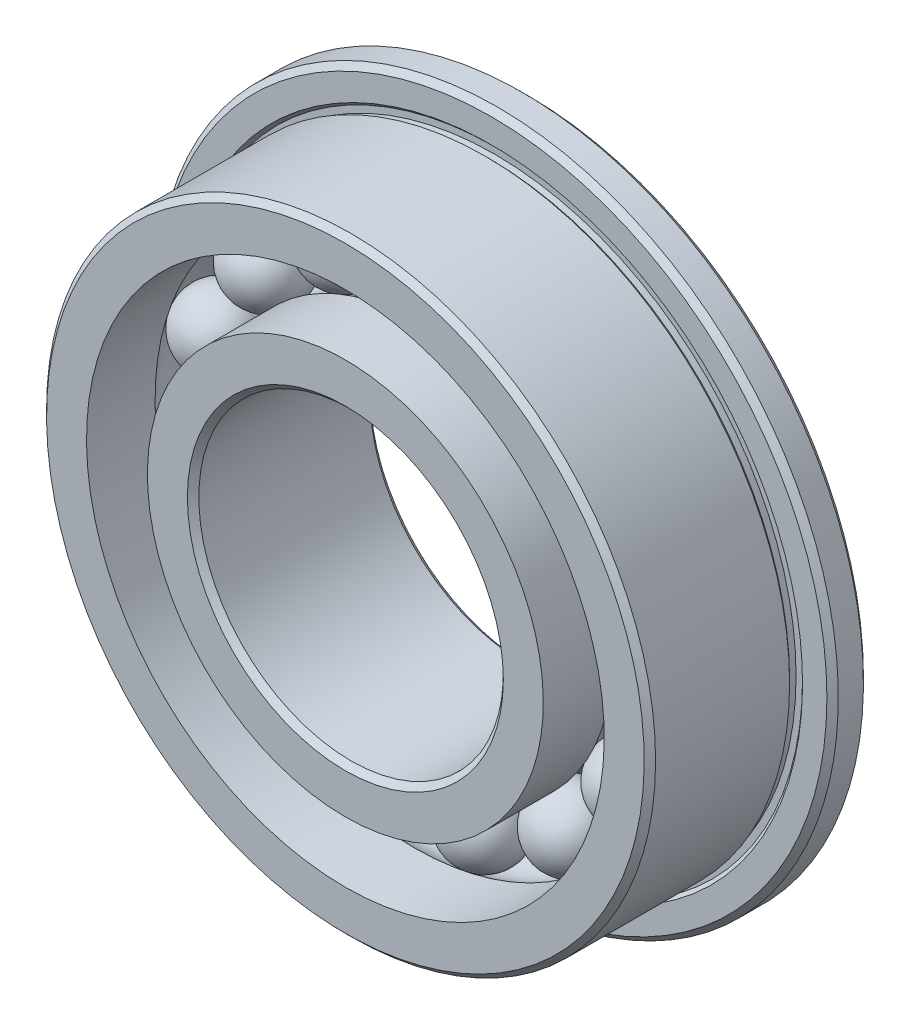
ISO-10303-21;
HEADER;
FILE_DESCRIPTION(('STEP AP214'),'2;1');
FILE_NAME('part.step','',(''),(''),'','','');
FILE_SCHEMA(('AUTOMOTIVE_DESIGN { 1 0 10303 214 1 1 1 1 }'));
ENDSEC;
DATA;
#1=APPLICATION_CONTEXT('core data for automotive mechanical design processes');
#2=APPLICATION_PROTOCOL_DEFINITION('international standard','automotive_design',2000,#1);
#3=PRODUCT_CONTEXT('',#1,'mechanical');
#4=PRODUCT('Part','Part','',(#3));
#5=PRODUCT_RELATED_PRODUCT_CATEGORY('part','',(#4));
#6=PRODUCT_DEFINITION_FORMATION('','',#4);
#7=PRODUCT_DEFINITION_CONTEXT('part definition',#1,'design');
#8=PRODUCT_DEFINITION('design','',#6,#7);
#9=PRODUCT_DEFINITION_SHAPE('','',#8);
#10=(LENGTH_UNIT() NAMED_UNIT(*) SI_UNIT(.MILLI.,.METRE.));
#11=(NAMED_UNIT(*) PLANE_ANGLE_UNIT() SI_UNIT($,.RADIAN.));
#12=(NAMED_UNIT(*) SI_UNIT($,.STERADIAN.) SOLID_ANGLE_UNIT());
#13=UNCERTAINTY_MEASURE_WITH_UNIT(LENGTH_MEASURE(1.E-05),#10,'distance_accuracy_value','');
#14=(GEOMETRIC_REPRESENTATION_CONTEXT(3) GLOBAL_UNCERTAINTY_ASSIGNED_CONTEXT((#13)) GLOBAL_UNIT_ASSIGNED_CONTEXT((#10,
#11,#12)) REPRESENTATION_CONTEXT('',''));
#15=CARTESIAN_POINT('',(0.,0.,0.));
#16=DIRECTION('',(0.,0.,1.));
#17=DIRECTION('',(1.,0.,0.));
#18=AXIS2_PLACEMENT_3D('',#15,#16,#17);
#19=CARTESIAN_POINT('',(-1.52526241153421,3.42579546615977,0.));
#20=DIRECTION('',(-0.406736643075789,0.913545457642606,0.));
#21=DIRECTION('',(0.913545457642606,0.406736643075789,0.));
#22=AXIS2_PLACEMENT_3D('',#19,#20,#21);
#23=SPHERICAL_SURFACE('',#22,0.625);
#24=CARTESIAN_POINT('',(-1.77947281345658,3.9967613771864,0.));
#25=VERTEX_POINT('',#24);
#26=VERTEX_LOOP('',#25);
#27=FACE_BOUND('',#26,.T.);
#28=ADVANCED_FACE('F39',(#27),#23,.T.);
#29=CLOSED_SHELL('',(#28));
#30=MANIFOLD_SOLID_BREP('B2',#29);
#31=CARTESIAN_POINT('',(-2.7867930955402,2.50923977384575,0.));
#32=DIRECTION('',(-0.743144825477386,0.669130606358867,0.));
#33=DIRECTION('',(0.669130606358867,0.743144825477386,0.));
#34=AXIS2_PLACEMENT_3D('',#31,#32,#33);
#35=SPHERICAL_SURFACE('',#34,0.625);
#36=CARTESIAN_POINT('',(-3.25125861146356,2.92744640282004,0.));
#37=VERTEX_POINT('',#36);
#38=VERTEX_LOOP('',#37);
#39=FACE_BOUND('',#38,.T.);
#40=ADVANCED_FACE('F57',(#39),#35,.T.);
#41=CLOSED_SHELL('',(#40));
#42=MANIFOLD_SOLID_BREP('B7',#41);
#43=CARTESIAN_POINT('',(-3.56646193610681,1.15881372890609,0.));
#44=DIRECTION('',(-0.95105651629515,0.309016994374957,0.));
#45=DIRECTION('',(0.309016994374957,0.95105651629515,0.));
#46=AXIS2_PLACEMENT_3D('',#43,#44,#45);
#47=SPHERICAL_SURFACE('',#46,0.625);
#48=CARTESIAN_POINT('',(-4.16087225879128,1.35194935039044,0.));
#49=VERTEX_POINT('',#48);
#50=VERTEX_LOOP('',#49);
#51=FACE_BOUND('',#50,.T.);
#52=ADVANCED_FACE('F75',(#51),#47,.T.);
#53=CLOSED_SHELL('',(#52));
#54=MANIFOLD_SOLID_BREP('B35',#53);
#55=CARTESIAN_POINT('',(-3.72945710763103,-0.391981737253664,0.));
#56=DIRECTION('',(-0.994521895368274,-0.104528463267644,0.));
#57=DIRECTION('',(-0.104528463267644,0.994521895368274,0.));
#58=AXIS2_PLACEMENT_3D('',#55,#56,#57);
#59=SPHERICAL_SURFACE('',#58,0.625);
#60=CARTESIAN_POINT('',(-4.3510332922362,-0.457312026795941,0.));
#61=VERTEX_POINT('',#60);
#62=VERTEX_LOOP('',#61);
#63=FACE_BOUND('',#62,.T.);
#64=ADVANCED_FACE('F93',(#63),#59,.T.);
#65=CLOSED_SHELL('',(#64));
#66=MANIFOLD_SOLID_BREP('B53',#65);
#67=CARTESIAN_POINT('',(-3.24759526419166,-1.87499999999997,0.));
#68=DIRECTION('',(-0.866025403784443,-0.499999999999992,0.));
#69=DIRECTION('',(-0.499999999999992,0.866025403784443,0.));
#70=AXIS2_PLACEMENT_3D('',#67,#68,#69);
#71=SPHERICAL_SURFACE('',#70,0.625);
#72=CARTESIAN_POINT('',(-3.78886114155694,-2.18749999999996,0.));
#73=VERTEX_POINT('',#72);
#74=VERTEX_LOOP('',#73);
#75=FACE_BOUND('',#74,.T.);
#76=ADVANCED_FACE('F111',(#75),#71,.T.);
#77=CLOSED_SHELL('',(#76));
#78=MANIFOLD_SOLID_BREP('B71',#77);
#79=CARTESIAN_POINT('',(-2.2041946960968,-3.03381372890603,0.));
#80=DIRECTION('',(-0.58778525229248,-0.809016994374943,0.));
#81=DIRECTION('',(-0.809016994374943,0.58778525229248,0.));
#82=AXIS2_PLACEMENT_3D('',#79,#80,#81);
#83=SPHERICAL_SURFACE('',#82,0.625);
#84=CARTESIAN_POINT('',(-2.5715604787796,-3.53944935039037,0.));
#85=VERTEX_POINT('',#84);
#86=VERTEX_LOOP('',#85);
#87=FACE_BOUND('',#86,.T.);
#88=ADVANCED_FACE('F129',(#87),#83,.T.);
#89=CLOSED_SHELL('',(#88));
#90=MANIFOLD_SOLID_BREP('B89',#89);
#91=CARTESIAN_POINT('',(-0.779668840566624,-3.66805350275177,0.));
#92=DIRECTION('',(-0.207911690817766,-0.978147600733804,0.));
#93=DIRECTION('',(-0.978147600733804,0.207911690817766,0.));
#94=AXIS2_PLACEMENT_3D('',#91,#92,#93);
#95=SPHERICAL_SURFACE('',#94,0.625);
#96=CARTESIAN_POINT('',(-0.909613647327728,-4.27939575321039,0.));
#97=VERTEX_POINT('',#96);
#98=VERTEX_LOOP('',#97);
#99=FACE_BOUND('',#98,.T.);
#100=ADVANCED_FACE('F147',(#99),#95,.T.);
#101=CLOSED_SHELL('',(#100));
#102=MANIFOLD_SOLID_BREP('B107',#101);
#103=CARTESIAN_POINT('',(0.779668840566575,-3.66805350275178,0.));
#104=DIRECTION('',(0.207911690817753,-0.978147600733807,0.));
#105=DIRECTION('',(-0.978147600733807,-0.207911690817753,0.));
#106=AXIS2_PLACEMENT_3D('',#103,#104,#105);
#107=SPHERICAL_SURFACE('',#106,0.625);
#108=CARTESIAN_POINT('',(0.90961364732767,-4.2793957532104,0.));
#109=VERTEX_POINT('',#108);
#110=VERTEX_LOOP('',#109);
#111=FACE_BOUND('',#110,.T.);
#112=ADVANCED_FACE('F165',(#111),#107,.T.);
#113=CLOSED_SHELL('',(#112));
#114=MANIFOLD_SOLID_BREP('B125',#113);
#115=CARTESIAN_POINT('',(2.20419469609676,-3.03381372890606,0.));
#116=DIRECTION('',(0.587785252292469,-0.80901699437495,0.));
#117=DIRECTION('',(-0.80901699437495,-0.587785252292469,0.));
#118=AXIS2_PLACEMENT_3D('',#115,#116,#117);
#119=SPHERICAL_SURFACE('',#118,0.625);
#120=CARTESIAN_POINT('',(2.57156047877955,-3.53944935039041,0.));
#121=VERTEX_POINT('',#120);
#122=VERTEX_LOOP('',#121);
#123=FACE_BOUND('',#122,.T.);
#124=ADVANCED_FACE('F183',(#123),#119,.T.);
#125=CLOSED_SHELL('',(#124));
#126=MANIFOLD_SOLID_BREP('B143',#125);
#127=CARTESIAN_POINT('',(3.24759526419164,-1.87500000000002,0.));
#128=DIRECTION('',(0.866025403784437,-0.500000000000004,0.));
#129=DIRECTION('',(-0.500000000000004,-0.866025403784437,0.));
#130=AXIS2_PLACEMENT_3D('',#127,#128,#129);
#131=SPHERICAL_SURFACE('',#130,0.625);
#132=CARTESIAN_POINT('',(3.78886114155691,-2.18750000000002,0.));
#133=VERTEX_POINT('',#132);
#134=VERTEX_LOOP('',#133);
#135=FACE_BOUND('',#134,.T.);
#136=ADVANCED_FACE('F201',(#135),#131,.T.);
#137=CLOSED_SHELL('',(#136));
#138=MANIFOLD_SOLID_BREP('B161',#137);
#139=CARTESIAN_POINT('',(3.72945710763102,-0.391981737253714,0.));
#140=DIRECTION('',(0.994521895368273,-0.104528463267657,0.));
#141=DIRECTION('',(-0.104528463267657,-0.994521895368273,0.));
#142=AXIS2_PLACEMENT_3D('',#139,#140,#141);
#143=SPHERICAL_SURFACE('',#142,0.625);
#144=CARTESIAN_POINT('',(4.35103329223619,-0.457312026796,0.));
#145=VERTEX_POINT('',#144);
#146=VERTEX_LOOP('',#145);
#147=FACE_BOUND('',#146,.T.);
#148=ADVANCED_FACE('F219',(#147),#143,.T.);
#149=CLOSED_SHELL('',(#148));
#150=MANIFOLD_SOLID_BREP('B179',#149);
#151=CARTESIAN_POINT('',(3.56646193610683,1.15881372890604,0.));
#152=DIRECTION('',(0.951056516295154,0.309016994374945,0.));
#153=DIRECTION('',(0.309016994374945,-0.951056516295154,0.));
#154=AXIS2_PLACEMENT_3D('',#151,#152,#153);
#155=SPHERICAL_SURFACE('',#154,0.625);
#156=CARTESIAN_POINT('',(4.1608722587913,1.35194935039038,0.));
#157=VERTEX_POINT('',#156);
#158=VERTEX_LOOP('',#157);
#159=FACE_BOUND('',#158,.T.);
#160=ADVANCED_FACE('F237',(#159),#155,.T.);
#161=CLOSED_SHELL('',(#160));
#162=MANIFOLD_SOLID_BREP('B197',#161);
#163=CARTESIAN_POINT('',(2.78679309554023,2.50923977384571,0.));
#164=DIRECTION('',(0.743144825477395,0.669130606358857,0.));
#165=DIRECTION('',(0.669130606358857,-0.743144825477395,0.));
#166=AXIS2_PLACEMENT_3D('',#163,#164,#165);
#167=SPHERICAL_SURFACE('',#166,0.625);
#168=CARTESIAN_POINT('',(3.25125861146361,2.92744640282,0.));
#169=VERTEX_POINT('',#168);
#170=VERTEX_LOOP('',#169);
#171=FACE_BOUND('',#170,.T.);
#172=ADVANCED_FACE('F255',(#171),#167,.T.);
#173=CLOSED_SHELL('',(#172));
#174=MANIFOLD_SOLID_BREP('B215',#173);
#175=CARTESIAN_POINT('',(1.52526241153425,3.42579546615975,0.));
#176=DIRECTION('',(0.406736643075801,0.913545457642601,0.));
#177=DIRECTION('',(0.913545457642601,-0.406736643075801,0.));
#178=AXIS2_PLACEMENT_3D('',#175,#176,#177);
#179=SPHERICAL_SURFACE('',#178,0.625);
#180=CARTESIAN_POINT('',(1.77947281345663,3.99676137718638,0.));
#181=VERTEX_POINT('',#180);
#182=VERTEX_LOOP('',#181);
#183=FACE_BOUND('',#182,.T.);
#184=ADVANCED_FACE('F273',(#183),#179,.T.);
#185=CLOSED_SHELL('',(#184));
#186=MANIFOLD_SOLID_BREP('B233',#185);
#187=CARTESIAN_POINT('',(0.,3.75,0.));
#188=DIRECTION('',(0.,1.,0.));
#189=DIRECTION('',(1.,0.,0.));
#190=AXIS2_PLACEMENT_3D('',#187,#188,#189);
#191=SPHERICAL_SURFACE('',#190,0.625);
#192=CARTESIAN_POINT('',(0.,4.375,0.));
#193=VERTEX_POINT('',#192);
#194=VERTEX_LOOP('',#193);
#195=FACE_BOUND('',#194,.T.);
#196=ADVANCED_FACE('F294',(#195),#191,.T.);
#197=CLOSED_SHELL('',(#196));
#198=MANIFOLD_SOLID_BREP('B251',#197);
#199=CARTESIAN_POINT('',(0.,0.,0.));
#200=DIRECTION('',(0.,0.,1.));
#201=DIRECTION('',(0.,-1.,0.));
#202=AXIS2_PLACEMENT_3D('',#199,#200,#201);
#203=CYLINDRICAL_SURFACE('',#202,3.25);
#204=CARTESIAN_POINT('',(0.,0.,-0.374999999999998));
#205=DIRECTION('',(0.,0.,1.));
#206=DIRECTION('',(0.,-1.,0.));
#207=AXIS2_PLACEMENT_3D('',#204,#205,#206);
#208=CIRCLE('',#207,3.25);
#209=CARTESIAN_POINT('',(0.,-3.25,-0.374999999999998));
#210=VERTEX_POINT('',#209);
#211=EDGE_CURVE('E335',#210,#210,#208,.T.);
#212=ORIENTED_EDGE('',*,*,#211,.F.);
#213=EDGE_LOOP('',(#212));
#214=FACE_BOUND('',#213,.T.);
#215=CARTESIAN_POINT('',(0.,0.,-1.5));
#216=DIRECTION('',(0.,0.,1.));
#217=DIRECTION('',(0.,-1.,0.));
#218=AXIS2_PLACEMENT_3D('',#215,#216,#217);
#219=CIRCLE('',#218,3.25);
#220=CARTESIAN_POINT('',(0.,-3.25,-1.5));
#221=VERTEX_POINT('',#220);
#222=EDGE_CURVE('E344',#221,#221,#219,.T.);
#223=ORIENTED_EDGE('',*,*,#222,.T.);
#224=EDGE_LOOP('',(#223));
#225=FACE_BOUND('',#224,.T.);
#226=ADVANCED_FACE('F315',(#214,#225),#203,.T.);
#227=CARTESIAN_POINT('',(0.,0.,0.));
#228=DIRECTION('',(0.,0.,1.));
#229=DIRECTION('',(0.,-1.,0.));
#230=AXIS2_PLACEMENT_3D('',#227,#228,#229);
#231=TOROIDAL_SURFACE('',#230,3.75,0.625);
#232=CARTESIAN_POINT('',(0.,0.,0.374999999999999));
#233=DIRECTION('',(0.,0.,1.));
#234=DIRECTION('',(0.,-1.,0.));
#235=AXIS2_PLACEMENT_3D('',#232,#233,#234);
#236=CIRCLE('',#235,3.25);
#237=CARTESIAN_POINT('',(0.,-3.25,0.374999999999999));
#238=VERTEX_POINT('',#237);
#239=EDGE_CURVE('E338',#238,#238,#236,.T.);
#240=ORIENTED_EDGE('',*,*,#239,.F.);
#241=EDGE_LOOP('',(#240));
#242=FACE_BOUND('',#241,.T.);
#243=ORIENTED_EDGE('',*,*,#211,.T.);
#244=EDGE_LOOP('',(#243));
#245=FACE_BOUND('',#244,.T.);
#246=ADVANCED_FACE('F363',(#242,#245),#231,.F.);
#247=CARTESIAN_POINT('',(0.,0.,0.));
#248=DIRECTION('',(0.,0.,1.));
#249=DIRECTION('',(0.,-1.,0.));
#250=AXIS2_PLACEMENT_3D('',#247,#248,#249);
#251=CYLINDRICAL_SURFACE('',#250,3.25);
#252=CARTESIAN_POINT('',(0.,0.,1.5));
#253=DIRECTION('',(0.,0.,1.));
#254=DIRECTION('',(0.,-1.,0.));
#255=AXIS2_PLACEMENT_3D('',#252,#253,#254);
#256=CIRCLE('',#255,3.25);
#257=CARTESIAN_POINT('',(0.,-3.25,1.5));
#258=VERTEX_POINT('',#257);
#259=EDGE_CURVE('E341',#258,#258,#256,.T.);
#260=ORIENTED_EDGE('',*,*,#259,.F.);
#261=EDGE_LOOP('',(#260));
#262=FACE_BOUND('',#261,.T.);
#263=ORIENTED_EDGE('',*,*,#239,.T.);
#264=EDGE_LOOP('',(#263));
#265=FACE_BOUND('',#264,.T.);
#266=ADVANCED_FACE('F369',(#262,#265),#251,.T.);
#267=CARTESIAN_POINT('',(0.,2.5,1.5));
#268=DIRECTION('',(0.,0.,-1.));
#269=DIRECTION('',(0.,1.,0.));
#270=AXIS2_PLACEMENT_3D('',#267,#268,#269);
#271=PLANE('',#270);
#272=CARTESIAN_POINT('',(0.,0.,1.5));
#273=DIRECTION('',(0.,0.,-1.));
#274=DIRECTION('',(0.,1.,0.));
#275=AXIS2_PLACEMENT_3D('',#272,#273,#274);
#276=CIRCLE('',#275,2.59375);
#277=CARTESIAN_POINT('',(0.,2.59375,1.5));
#278=VERTEX_POINT('',#277);
#279=EDGE_CURVE('E293',#278,#278,#276,.T.);
#280=ORIENTED_EDGE('',*,*,#279,.T.);
#281=EDGE_LOOP('',(#280));
#282=FACE_BOUND('',#281,.T.);
#283=ORIENTED_EDGE('',*,*,#259,.T.);
#284=EDGE_LOOP('',(#283));
#285=FACE_BOUND('',#284,.T.);
#286=ADVANCED_FACE('F360',(#282,#285),#271,.F.);
#287=CARTESIAN_POINT('',(0.,0.,0.));
#288=DIRECTION('',(0.,0.,1.));
#289=DIRECTION('',(0.,-1.,0.));
#290=AXIS2_PLACEMENT_3D('',#287,#288,#289);
#291=CYLINDRICAL_SURFACE('',#290,2.5);
#292=CARTESIAN_POINT('',(0.,0.,-1.40625));
#293=DIRECTION('',(0.,0.,1.));
#294=DIRECTION('',(0.,-1.,0.));
#295=AXIS2_PLACEMENT_3D('',#292,#293,#294);
#296=CIRCLE('',#295,2.5);
#297=CARTESIAN_POINT('',(0.,-2.5,-1.40625));
#298=VERTEX_POINT('',#297);
#299=EDGE_CURVE('E322',#298,#298,#296,.F.);
#300=ORIENTED_EDGE('',*,*,#299,.T.);
#301=EDGE_LOOP('',(#300));
#302=FACE_BOUND('',#301,.T.);
#303=CARTESIAN_POINT('',(0.,0.,1.40625));
#304=DIRECTION('',(0.,0.,-1.));
#305=DIRECTION('',(0.,1.,0.));
#306=AXIS2_PLACEMENT_3D('',#303,#304,#305);
#307=CIRCLE('',#306,2.5);
#308=CARTESIAN_POINT('',(0.,2.5,1.40625));
#309=VERTEX_POINT('',#308);
#310=EDGE_CURVE('E326',#309,#309,#307,.F.);
#311=ORIENTED_EDGE('',*,*,#310,.T.);
#312=EDGE_LOOP('',(#311));
#313=FACE_BOUND('',#312,.T.);
#314=ADVANCED_FACE('F352',(#302,#313),#291,.F.);
#315=CARTESIAN_POINT('',(0.,3.25,-1.5));
#316=DIRECTION('',(0.,0.,1.));
#317=DIRECTION('',(0.,-1.,0.));
#318=AXIS2_PLACEMENT_3D('',#315,#316,#317);
#319=PLANE('',#318);
#320=CARTESIAN_POINT('',(0.,0.,-1.5));
#321=DIRECTION('',(0.,0.,1.));
#322=DIRECTION('',(0.,-1.,0.));
#323=AXIS2_PLACEMENT_3D('',#320,#321,#322);
#324=CIRCLE('',#323,2.59375);
#325=CARTESIAN_POINT('',(0.,-2.59375,-1.5));
#326=VERTEX_POINT('',#325);
#327=EDGE_CURVE('E330',#326,#326,#324,.T.);
#328=ORIENTED_EDGE('',*,*,#327,.T.);
#329=EDGE_LOOP('',(#328));
#330=FACE_BOUND('',#329,.T.);
#331=ORIENTED_EDGE('',*,*,#222,.F.);
#332=EDGE_LOOP('',(#331));
#333=FACE_BOUND('',#332,.T.);
#334=ADVANCED_FACE('F349',(#330,#333),#319,.F.);
#335=CARTESIAN_POINT('',(0.,0.,-1.5));
#336=DIRECTION('',(0.,0.,-1.));
#337=DIRECTION('',(0.,1.,0.));
#338=AXIS2_PLACEMENT_3D('',#335,#336,#337);
#339=CONICAL_SURFACE('',#338,2.59375,0.785398163397448);
#340=ORIENTED_EDGE('',*,*,#299,.F.);
#341=EDGE_LOOP('',(#340));
#342=FACE_BOUND('',#341,.T.);
#343=ORIENTED_EDGE('',*,*,#327,.F.);
#344=EDGE_LOOP('',(#343));
#345=FACE_BOUND('',#344,.T.);
#346=ADVANCED_FACE('F351',(#342,#345),#339,.F.);
#347=CARTESIAN_POINT('',(0.,0.,1.40625));
#348=DIRECTION('',(0.,0.,1.));
#349=DIRECTION('',(0.,-1.,0.));
#350=AXIS2_PLACEMENT_3D('',#347,#348,#349);
#351=CONICAL_SURFACE('',#350,2.5,0.785398163397448);
#352=ORIENTED_EDGE('',*,*,#279,.F.);
#353=EDGE_LOOP('',(#352));
#354=FACE_BOUND('',#353,.T.);
#355=ORIENTED_EDGE('',*,*,#310,.F.);
#356=EDGE_LOOP('',(#355));
#357=FACE_BOUND('',#356,.T.);
#358=ADVANCED_FACE('F317',(#354,#357),#351,.F.);
#359=CLOSED_SHELL('',(#226,#246,#266,#286,#314,#334,#346,#358));
#360=MANIFOLD_SOLID_BREP('B269',#359);
#361=CARTESIAN_POINT('',(0.,4.25,-1.5));
#362=DIRECTION('',(0.,0.,1.));
#363=DIRECTION('',(0.,-1.,0.));
#364=AXIS2_PLACEMENT_3D('',#361,#362,#363);
#365=PLANE('',#364);
#366=CARTESIAN_POINT('',(0.,0.,-1.5));
#367=DIRECTION('',(0.,0.,1.));
#368=DIRECTION('',(0.,-1.,0.));
#369=AXIS2_PLACEMENT_3D('',#366,#367,#368);
#370=CIRCLE('',#369,5.50625);
#371=CARTESIAN_POINT('',(0.,-5.50625,-1.5));
#372=VERTEX_POINT('',#371);
#373=EDGE_CURVE('E452',#372,#372,#370,.F.);
#374=ORIENTED_EDGE('',*,*,#373,.T.);
#375=EDGE_LOOP('',(#374));
#376=FACE_BOUND('',#375,.T.);
#377=CARTESIAN_POINT('',(0.,0.,-1.5));
#378=DIRECTION('',(0.,0.,1.));
#379=DIRECTION('',(0.,-1.,0.));
#380=AXIS2_PLACEMENT_3D('',#377,#378,#379);
#381=CIRCLE('',#380,4.25);
#382=CARTESIAN_POINT('',(0.,-4.25,-1.5));
#383=VERTEX_POINT('',#382);
#384=EDGE_CURVE('E463',#383,#383,#381,.T.);
#385=ORIENTED_EDGE('',*,*,#384,.T.);
#386=EDGE_LOOP('',(#385));
#387=FACE_BOUND('',#386,.T.);
#388=ADVANCED_FACE('F437',(#376,#387),#365,.F.);
#389=CARTESIAN_POINT('',(0.,0.,0.));
#390=DIRECTION('',(0.,0.,1.));
#391=DIRECTION('',(0.,-1.,0.));
#392=AXIS2_PLACEMENT_3D('',#389,#390,#391);
#393=CYLINDRICAL_SURFACE('',#392,4.25);
#394=ORIENTED_EDGE('',*,*,#384,.F.);
#395=EDGE_LOOP('',(#394));
#396=FACE_BOUND('',#395,.T.);
#397=CARTESIAN_POINT('',(0.,0.,-0.374999999999998));
#398=DIRECTION('',(0.,0.,1.));
#399=DIRECTION('',(0.,-1.,0.));
#400=AXIS2_PLACEMENT_3D('',#397,#398,#399);
#401=CIRCLE('',#400,4.25);
#402=CARTESIAN_POINT('',(0.,-4.25,-0.374999999999998));
#403=VERTEX_POINT('',#402);
#404=EDGE_CURVE('E466',#403,#403,#401,.T.);
#405=ORIENTED_EDGE('',*,*,#404,.T.);
#406=EDGE_LOOP('',(#405));
#407=FACE_BOUND('',#406,.T.);
#408=ADVANCED_FACE('F509',(#396,#407),#393,.F.);
#409=CARTESIAN_POINT('',(0.,0.,0.));
#410=DIRECTION('',(0.,0.,1.));
#411=DIRECTION('',(0.,-1.,0.));
#412=AXIS2_PLACEMENT_3D('',#409,#410,#411);
#413=TOROIDAL_SURFACE('',#412,3.75,0.625);
#414=ORIENTED_EDGE('',*,*,#404,.F.);
#415=EDGE_LOOP('',(#414));
#416=FACE_BOUND('',#415,.T.);
#417=CARTESIAN_POINT('',(0.,0.,0.374999999999999));
#418=DIRECTION('',(0.,0.,1.));
#419=DIRECTION('',(0.,-1.,0.));
#420=AXIS2_PLACEMENT_3D('',#417,#418,#419);
#421=CIRCLE('',#420,4.25);
#422=CARTESIAN_POINT('',(0.,-4.25,0.375));
#423=VERTEX_POINT('',#422);
#424=EDGE_CURVE('E469',#423,#423,#421,.T.);
#425=ORIENTED_EDGE('',*,*,#424,.T.);
#426=EDGE_LOOP('',(#425));
#427=FACE_BOUND('',#426,.T.);
#428=ADVANCED_FACE('F515',(#416,#427),#413,.F.);
#429=CARTESIAN_POINT('',(0.,0.,0.));
#430=DIRECTION('',(0.,0.,1.));
#431=DIRECTION('',(0.,-1.,0.));
#432=AXIS2_PLACEMENT_3D('',#429,#430,#431);
#433=CYLINDRICAL_SURFACE('',#432,4.25);
#434=ORIENTED_EDGE('',*,*,#424,.F.);
#435=EDGE_LOOP('',(#434));
#436=FACE_BOUND('',#435,.T.);
#437=CARTESIAN_POINT('',(0.,0.,1.5));
#438=DIRECTION('',(0.,0.,1.));
#439=DIRECTION('',(0.,-1.,0.));
#440=AXIS2_PLACEMENT_3D('',#437,#438,#439);
#441=CIRCLE('',#440,4.25);
#442=CARTESIAN_POINT('',(0.,-4.25,1.5));
#443=VERTEX_POINT('',#442);
#444=EDGE_CURVE('E472',#443,#443,#441,.T.);
#445=ORIENTED_EDGE('',*,*,#444,.T.);
#446=EDGE_LOOP('',(#445));
#447=FACE_BOUND('',#446,.T.);
#448=ADVANCED_FACE('F579',(#436,#447),#433,.F.);
#449=CARTESIAN_POINT('',(0.,5.,1.5));
#450=DIRECTION('',(0.,0.,-1.));
#451=DIRECTION('',(0.,1.,0.));
#452=AXIS2_PLACEMENT_3D('',#449,#450,#451);
#453=PLANE('',#452);
#454=CARTESIAN_POINT('',(0.,0.,1.5));
#455=DIRECTION('',(0.,0.,-1.));
#456=DIRECTION('',(0.,1.,0.));
#457=AXIS2_PLACEMENT_3D('',#454,#455,#456);
#458=CIRCLE('',#457,4.90625);
#459=CARTESIAN_POINT('',(0.,4.90625,1.5));
#460=VERTEX_POINT('',#459);
#461=EDGE_CURVE('E444',#460,#460,#458,.F.);
#462=ORIENTED_EDGE('',*,*,#461,.T.);
#463=EDGE_LOOP('',(#462));
#464=FACE_BOUND('',#463,.T.);
#465=ORIENTED_EDGE('',*,*,#444,.F.);
#466=EDGE_LOOP('',(#465));
#467=FACE_BOUND('',#466,.T.);
#468=ADVANCED_FACE('F569',(#464,#467),#453,.F.);
#469=CARTESIAN_POINT('',(0.,0.,0.));
#470=DIRECTION('',(0.,0.,1.));
#471=DIRECTION('',(0.,-1.,0.));
#472=AXIS2_PLACEMENT_3D('',#469,#470,#471);
#473=CYLINDRICAL_SURFACE('',#472,5.);
#474=CARTESIAN_POINT('',(0.,0.,1.40625));
#475=DIRECTION('',(0.,0.,-1.));
#476=DIRECTION('',(0.,1.,0.));
#477=AXIS2_PLACEMENT_3D('',#474,#475,#476);
#478=CIRCLE('',#477,5.);
#479=CARTESIAN_POINT('',(0.,5.,1.40625));
#480=VERTEX_POINT('',#479);
#481=EDGE_CURVE('E314',#480,#480,#478,.T.);
#482=ORIENTED_EDGE('',*,*,#481,.T.);
#483=EDGE_LOOP('',(#482));
#484=FACE_BOUND('',#483,.T.);
#485=CARTESIAN_POINT('',(0.,0.,-0.793933982822018));
#486=DIRECTION('',(0.,0.,1.));
#487=DIRECTION('',(0.,-1.,0.));
#488=AXIS2_PLACEMENT_3D('',#485,#486,#487);
#489=CIRCLE('',#488,5.);
#490=CARTESIAN_POINT('',(0.,-5.,-0.793933982822018));
#491=VERTEX_POINT('',#490);
#492=EDGE_CURVE('E475',#491,#491,#489,.T.);
#493=ORIENTED_EDGE('',*,*,#492,.T.);
#494=EDGE_LOOP('',(#493));
#495=FACE_BOUND('',#494,.T.);
#496=ADVANCED_FACE('F563',(#484,#495),#473,.T.);
#497=CARTESIAN_POINT('',(0.,0.,-0.84696699141101));
#498=DIRECTION('',(0.,0.,1.));
#499=DIRECTION('',(0.,-1.,0.));
#500=AXIS2_PLACEMENT_3D('',#497,#498,#499);
#501=CONICAL_SURFACE('',#500,4.94696699141101,0.785398163397449);
#502=ORIENTED_EDGE('',*,*,#492,.F.);
#503=EDGE_LOOP('',(#502));
#504=FACE_BOUND('',#503,.T.);
#505=CARTESIAN_POINT('',(0.,0.,-0.84696699141101));
#506=DIRECTION('',(0.,0.,1.));
#507=DIRECTION('',(0.,-1.,0.));
#508=AXIS2_PLACEMENT_3D('',#505,#506,#507);
#509=CIRCLE('',#508,4.94696699141101);
#510=CARTESIAN_POINT('',(0.,-4.94696699141101,-0.846966991411009));
#511=VERTEX_POINT('',#510);
#512=EDGE_CURVE('E478',#511,#511,#509,.T.);
#513=ORIENTED_EDGE('',*,*,#512,.T.);
#514=EDGE_LOOP('',(#513));
#515=FACE_BOUND('',#514,.T.);
#516=ADVANCED_FACE('F568',(#504,#515),#501,.T.);
#517=CARTESIAN_POINT('',(0.,0.,0.));
#518=DIRECTION('',(0.,0.,1.));
#519=DIRECTION('',(0.,-1.,0.));
#520=AXIS2_PLACEMENT_3D('',#517,#518,#519);
#521=CYLINDRICAL_SURFACE('',#520,4.94696699141101);
#522=ORIENTED_EDGE('',*,*,#512,.F.);
#523=EDGE_LOOP('',(#522));
#524=FACE_BOUND('',#523,.T.);
#525=CARTESIAN_POINT('',(0.,0.,-0.953033008588992));
#526=DIRECTION('',(0.,0.,1.));
#527=DIRECTION('',(0.,-1.,0.));
#528=AXIS2_PLACEMENT_3D('',#525,#526,#527);
#529=CIRCLE('',#528,4.94696699141101);
#530=CARTESIAN_POINT('',(0.,-4.94696699141101,-0.953033008588992));
#531=VERTEX_POINT('',#530);
#532=EDGE_CURVE('E481',#531,#531,#529,.T.);
#533=ORIENTED_EDGE('',*,*,#532,.T.);
#534=EDGE_LOOP('',(#533));
#535=FACE_BOUND('',#534,.T.);
#536=ADVANCED_FACE('F601',(#524,#535),#521,.T.);
#537=CARTESIAN_POINT('',(0.,5.05303300858899,-0.953033008588993));
#538=DIRECTION('',(0.,0.,-1.));
#539=DIRECTION('',(0.,1.,0.));
#540=AXIS2_PLACEMENT_3D('',#537,#538,#539);
#541=PLANE('',#540);
#542=ORIENTED_EDGE('',*,*,#532,.F.);
#543=EDGE_LOOP('',(#542));
#544=FACE_BOUND('',#543,.T.);
#545=CARTESIAN_POINT('',(0.,0.,-0.953033008588992));
#546=DIRECTION('',(0.,0.,1.));
#547=DIRECTION('',(0.,-1.,0.));
#548=AXIS2_PLACEMENT_3D('',#545,#546,#547);
#549=CIRCLE('',#548,5.05303300858899);
#550=CARTESIAN_POINT('',(0.,-5.05303300858899,-0.953033008588992));
#551=VERTEX_POINT('',#550);
#552=EDGE_CURVE('E484',#551,#551,#549,.T.);
#553=ORIENTED_EDGE('',*,*,#552,.T.);
#554=EDGE_LOOP('',(#553));
#555=FACE_BOUND('',#554,.T.);
#556=ADVANCED_FACE('F505',(#544,#555),#541,.F.);
#557=CARTESIAN_POINT('',(0.,0.,-0.900000000000001));
#558=DIRECTION('',(0.,0.,1.));
#559=DIRECTION('',(0.,-1.,0.));
#560=AXIS2_PLACEMENT_3D('',#557,#558,#559);
#561=CONICAL_SURFACE('',#560,5.10606601717798,0.78539816339745);
#562=ORIENTED_EDGE('',*,*,#552,.F.);
#563=EDGE_LOOP('',(#562));
#564=FACE_BOUND('',#563,.T.);
#565=CARTESIAN_POINT('',(0.,0.,-0.900000000000001));
#566=DIRECTION('',(0.,0.,1.));
#567=DIRECTION('',(0.,-1.,0.));
#568=AXIS2_PLACEMENT_3D('',#565,#566,#567);
#569=CIRCLE('',#568,5.10606601717798);
#570=CARTESIAN_POINT('',(0.,-5.10606601717798,-0.9));
#571=VERTEX_POINT('',#570);
#572=EDGE_CURVE('E487',#571,#571,#569,.T.);
#573=ORIENTED_EDGE('',*,*,#572,.T.);
#574=EDGE_LOOP('',(#573));
#575=FACE_BOUND('',#574,.T.);
#576=ADVANCED_FACE('F491',(#564,#575),#561,.F.);
#577=CARTESIAN_POINT('',(0.,5.6,-0.900000000000001));
#578=DIRECTION('',(0.,0.,-1.));
#579=DIRECTION('',(0.,1.,0.));
#580=AXIS2_PLACEMENT_3D('',#577,#578,#579);
#581=PLANE('',#580);
#582=CARTESIAN_POINT('',(0.,0.,-0.9));
#583=DIRECTION('',(0.,0.,-1.));
#584=DIRECTION('',(0.,1.,0.));
#585=AXIS2_PLACEMENT_3D('',#582,#583,#584);
#586=CIRCLE('',#585,5.50625);
#587=CARTESIAN_POINT('',(0.,5.50625,-0.9));
#588=VERTEX_POINT('',#587);
#589=EDGE_CURVE('E448',#588,#588,#586,.F.);
#590=ORIENTED_EDGE('',*,*,#589,.T.);
#591=EDGE_LOOP('',(#590));
#592=FACE_BOUND('',#591,.T.);
#593=ORIENTED_EDGE('',*,*,#572,.F.);
#594=EDGE_LOOP('',(#593));
#595=FACE_BOUND('',#594,.T.);
#596=ADVANCED_FACE('F493',(#592,#595),#581,.F.);
#597=CARTESIAN_POINT('',(0.,0.,0.));
#598=DIRECTION('',(0.,0.,1.));
#599=DIRECTION('',(0.,-1.,0.));
#600=AXIS2_PLACEMENT_3D('',#597,#598,#599);
#601=CYLINDRICAL_SURFACE('',#600,5.6);
#602=CARTESIAN_POINT('',(0.,0.,-1.40625));
#603=DIRECTION('',(0.,0.,1.));
#604=DIRECTION('',(0.,-1.,0.));
#605=AXIS2_PLACEMENT_3D('',#602,#603,#604);
#606=CIRCLE('',#605,5.6);
#607=CARTESIAN_POINT('',(0.,-5.6,-1.40625));
#608=VERTEX_POINT('',#607);
#609=EDGE_CURVE('E457',#608,#608,#606,.T.);
#610=ORIENTED_EDGE('',*,*,#609,.T.);
#611=EDGE_LOOP('',(#610));
#612=FACE_BOUND('',#611,.T.);
#613=CARTESIAN_POINT('',(0.,0.,-0.99375));
#614=DIRECTION('',(0.,0.,-1.));
#615=DIRECTION('',(0.,1.,0.));
#616=AXIS2_PLACEMENT_3D('',#613,#614,#615);
#617=CIRCLE('',#616,5.6);
#618=CARTESIAN_POINT('',(0.,5.6,-0.993750000000001));
#619=VERTEX_POINT('',#618);
#620=EDGE_CURVE('E460',#619,#619,#617,.T.);
#621=ORIENTED_EDGE('',*,*,#620,.T.);
#622=EDGE_LOOP('',(#621));
#623=FACE_BOUND('',#622,.T.);
#624=ADVANCED_FACE('F495',(#612,#623),#601,.T.);
#625=CARTESIAN_POINT('',(0.,0.,-1.40625));
#626=DIRECTION('',(0.,0.,1.));
#627=DIRECTION('',(0.,-1.,0.));
#628=AXIS2_PLACEMENT_3D('',#625,#626,#627);
#629=CONICAL_SURFACE('',#628,5.6,0.785398163397448);
#630=ORIENTED_EDGE('',*,*,#373,.F.);
#631=EDGE_LOOP('',(#630));
#632=FACE_BOUND('',#631,.T.);
#633=ORIENTED_EDGE('',*,*,#609,.F.);
#634=EDGE_LOOP('',(#633));
#635=FACE_BOUND('',#634,.T.);
#636=ADVANCED_FACE('F502',(#632,#635),#629,.T.);
#637=CARTESIAN_POINT('',(0.,0.,-0.9));
#638=DIRECTION('',(0.,0.,-1.));
#639=DIRECTION('',(0.,1.,0.));
#640=AXIS2_PLACEMENT_3D('',#637,#638,#639);
#641=CONICAL_SURFACE('',#640,5.50625,0.785398163397448);
#642=CARTESIAN_POINT('',(0.,5.6,-0.993750000000001));
#643=CARTESIAN_POINT('',(0.,5.5990234375,-0.992773437500001));
#644=CARTESIAN_POINT('',(0.,5.598046875,-0.991796875000001));
#645=CARTESIAN_POINT('',(0.,5.59609375,-0.989843750000001));
#646=CARTESIAN_POINT('',(0.,5.5951171875,-0.988867187500001));
#647=CARTESIAN_POINT('',(0.,5.5931640625,-0.986914062500001));
#648=CARTESIAN_POINT('',(0.,5.5921875,-0.985937500000001));
#649=CARTESIAN_POINT('',(0.,5.590234375,-0.983984375000001));
#650=CARTESIAN_POINT('',(0.,5.5892578125,-0.983007812500001));
#651=CARTESIAN_POINT('',(0.,5.5873046875,-0.981054687500001));
#652=CARTESIAN_POINT('',(0.,5.586328125,-0.980078125000001));
#653=CARTESIAN_POINT('',(0.,5.584375,-0.978125000000001));
#654=CARTESIAN_POINT('',(0.,5.5833984375,-0.977148437500001));
#655=CARTESIAN_POINT('',(0.,5.5814453125,-0.975195312500001));
#656=CARTESIAN_POINT('',(0.,5.58046875,-0.974218750000001));
#657=CARTESIAN_POINT('',(0.,5.578515625,-0.972265625000001));
#658=CARTESIAN_POINT('',(0.,5.5775390625,-0.971289062500001));
#659=CARTESIAN_POINT('',(0.,5.5755859375,-0.969335937500001));
#660=CARTESIAN_POINT('',(0.,5.574609375,-0.968359375000001));
#661=CARTESIAN_POINT('',(0.,5.57265625,-0.966406250000001));
#662=CARTESIAN_POINT('',(0.,5.5716796875,-0.965429687500001));
#663=CARTESIAN_POINT('',(0.,5.5697265625,-0.963476562500001));
#664=CARTESIAN_POINT('',(0.,5.56875,-0.962500000000001));
#665=CARTESIAN_POINT('',(0.,5.566796875,-0.960546875000001));
#666=CARTESIAN_POINT('',(0.,5.5658203125,-0.959570312500001));
#667=CARTESIAN_POINT('',(0.,5.5638671875,-0.957617187500001));
#668=CARTESIAN_POINT('',(0.,5.562890625,-0.956640625000001));
#669=CARTESIAN_POINT('',(0.,5.5609375,-0.954687500000001));
#670=CARTESIAN_POINT('',(0.,5.5599609375,-0.953710937500001));
#671=CARTESIAN_POINT('',(0.,5.5580078125,-0.951757812500001));
#672=CARTESIAN_POINT('',(0.,5.55703125,-0.950781250000001));
#673=CARTESIAN_POINT('',(0.,5.555078125,-0.948828125000001));
#674=CARTESIAN_POINT('',(0.,5.5541015625,-0.947851562500001));
#675=CARTESIAN_POINT('',(0.,5.5521484375,-0.945898437500001));
#676=CARTESIAN_POINT('',(0.,5.551171875,-0.944921875000001));
#677=CARTESIAN_POINT('',(0.,5.54921875,-0.942968750000001));
#678=CARTESIAN_POINT('',(0.,5.5482421875,-0.941992187500001));
#679=CARTESIAN_POINT('',(0.,5.5462890625,-0.940039062500001));
#680=CARTESIAN_POINT('',(0.,5.5453125,-0.939062500000001));
#681=CARTESIAN_POINT('',(0.,5.543359375,-0.937109375000001));
#682=CARTESIAN_POINT('',(0.,5.5423828125,-0.936132812500001));
#683=CARTESIAN_POINT('',(0.,5.5404296875,-0.934179687500001));
#684=CARTESIAN_POINT('',(0.,5.539453125,-0.933203125000001));
#685=CARTESIAN_POINT('',(0.,5.5375,-0.931250000000001));
#686=CARTESIAN_POINT('',(0.,5.5365234375,-0.930273437500001));
#687=CARTESIAN_POINT('',(0.,5.5345703125,-0.928320312500001));
#688=CARTESIAN_POINT('',(0.,5.53359375,-0.927343750000001));
#689=CARTESIAN_POINT('',(0.,5.531640625,-0.925390625000001));
#690=CARTESIAN_POINT('',(0.,5.5306640625,-0.924414062500001));
#691=CARTESIAN_POINT('',(0.,5.5287109375,-0.922460937500001));
#692=CARTESIAN_POINT('',(0.,5.527734375,-0.921484375000001));
#693=CARTESIAN_POINT('',(0.,5.52578125,-0.919531250000001));
#694=CARTESIAN_POINT('',(0.,5.5248046875,-0.918554687500001));
#695=CARTESIAN_POINT('',(0.,5.5228515625,-0.916601562500001));
#696=CARTESIAN_POINT('',(0.,5.521875,-0.915625000000001));
#697=CARTESIAN_POINT('',(0.,5.519921875,-0.913671875000001));
#698=CARTESIAN_POINT('',(0.,5.5189453125,-0.912695312500001));
#699=CARTESIAN_POINT('',(0.,5.5169921875,-0.910742187500001));
#700=CARTESIAN_POINT('',(0.,5.516015625,-0.909765625000001));
#701=CARTESIAN_POINT('',(0.,5.5140625,-0.907812500000001));
#702=CARTESIAN_POINT('',(0.,5.5130859375,-0.906835937500001));
#703=CARTESIAN_POINT('',(0.,5.5111328125,-0.904882812500001));
#704=CARTESIAN_POINT('',(0.,5.51015625,-0.90390625));
#705=CARTESIAN_POINT('',(0.,5.508203125,-0.901953125));
#706=CARTESIAN_POINT('',(0.,5.5072265625,-0.9009765625));
#707=CARTESIAN_POINT('',(0.,5.50625,-0.900000000000001));
#708=B_SPLINE_CURVE_WITH_KNOTS('',3,(#642,#643,#644,#645,#646,#647,#648,#649,#650,#651,#652,
#653,#654,#655,#656,#657,#658,#659,#660,#661,#662,#663,#664,#665,#666,#667,#668,#669,#670,#671,
#672,#673,#674,#675,#676,#677,#678,#679,#680,#681,#682,#683,#684,#685,#686,#687,#688,#689,#690,
#691,#692,#693,#694,#695,#696,#697,#698,#699,#700,#701,#702,#703,#704,#705,#706,#707),
.UNSPECIFIED.,.F.,.F.,(4,2,2,2,2,2,2,2,2,2,2,2,2,2,2,2,2,2,2,2,2,2,2,2,2,2,2,2,2,2,2,2,4),(0.,
0.00414320379601508,0.00828640759203001,0.0124296113880451,0.0165728151840596,
0.0207160189800745,0.0248592227760895,0.0290024265721045,0.0331456303681195,0.0372888341641345,
0.0414320379601495,0.0455752417561645,0.0497184455521796,0.0538616493481939,0.058004853144209,
0.062148056940224,0.066291260736239,0.070434464532254,0.0745776683282691,0.0787208721242841,
0.0828640759202991,0.0870072797163135,0.0911504835123285,0.0952936873083435,0.0994368911043585,
0.103580094900373,0.107723298696388,0.111866502492404,0.116009706288419,0.120152910084433,
0.124296113880448,0.128439317676463,0.132582521472478),.UNSPECIFIED.);
#709=EDGE_CURVE('BSEAM522',#619,#588,#708,.T.);
#710=ORIENTED_EDGE('',*,*,#620,.F.);
#711=ORIENTED_EDGE('',*,*,#589,.F.);
#712=ORIENTED_EDGE('',*,*,#709,.T.);
#713=ORIENTED_EDGE('',*,*,#709,.F.);
#714=EDGE_LOOP('',(#710,#712,#711,#713));
#715=FACE_BOUND('',#714,.T.);
#716=ADVANCED_FACE('F522',(#715),#641,.T.);
#717=CARTESIAN_POINT('',(0.,0.,1.5));
#718=DIRECTION('',(0.,0.,-1.));
#719=DIRECTION('',(0.,1.,0.));
#720=AXIS2_PLACEMENT_3D('',#717,#718,#719);
#721=CONICAL_SURFACE('',#720,4.90625,0.785398163397448);
#722=ORIENTED_EDGE('',*,*,#481,.F.);
#723=EDGE_LOOP('',(#722));
#724=FACE_BOUND('',#723,.T.);
#725=ORIENTED_EDGE('',*,*,#461,.F.);
#726=EDGE_LOOP('',(#725));
#727=FACE_BOUND('',#726,.T.);
#728=ADVANCED_FACE('F439',(#724,#727),#721,.T.);
#729=CLOSED_SHELL('',(#388,#408,#428,#448,#468,#496,#516,#536,#556,#576,#596,#624,#636,#716,#728));
#730=MANIFOLD_SOLID_BREP('B288',#729);
#731=ADVANCED_BREP_SHAPE_REPRESENTATION('',(#18,#30,#42,#54,#66,#78,#90,#102,#114,#126,#138,
#150,#162,#174,#186,#198,#360,#730),#14);
#732=SHAPE_DEFINITION_REPRESENTATION(#9,#731);
ENDSEC;
END-ISO-10303-21;
